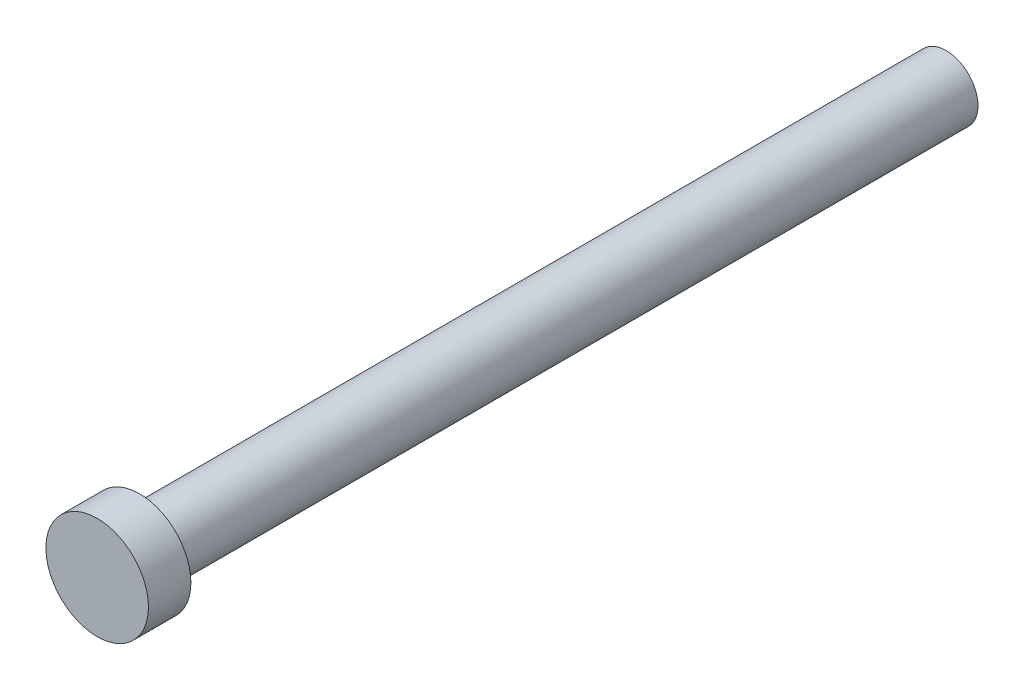
ISO-10303-21;
HEADER;
FILE_DESCRIPTION(('STEP AP214'),'2;1');
FILE_NAME('part.step','',(''),(''),'','','');
FILE_SCHEMA(('AUTOMOTIVE_DESIGN { 1 0 10303 214 1 1 1 1 }'));
ENDSEC;
DATA;
#1=APPLICATION_CONTEXT('core data for automotive mechanical design processes');
#2=APPLICATION_PROTOCOL_DEFINITION('international standard','automotive_design',2000,#1);
#3=PRODUCT_CONTEXT('',#1,'mechanical');
#4=PRODUCT('Part','Part','',(#3));
#5=PRODUCT_RELATED_PRODUCT_CATEGORY('part','',(#4));
#6=PRODUCT_DEFINITION_FORMATION('','',#4);
#7=PRODUCT_DEFINITION_CONTEXT('part definition',#1,'design');
#8=PRODUCT_DEFINITION('design','',#6,#7);
#9=PRODUCT_DEFINITION_SHAPE('','',#8);
#10=(LENGTH_UNIT() NAMED_UNIT(*) SI_UNIT(.MILLI.,.METRE.));
#11=(NAMED_UNIT(*) PLANE_ANGLE_UNIT() SI_UNIT($,.RADIAN.));
#12=(NAMED_UNIT(*) SI_UNIT($,.STERADIAN.) SOLID_ANGLE_UNIT());
#13=UNCERTAINTY_MEASURE_WITH_UNIT(LENGTH_MEASURE(1.E-05),#10,'distance_accuracy_value','');
#14=(GEOMETRIC_REPRESENTATION_CONTEXT(3) GLOBAL_UNCERTAINTY_ASSIGNED_CONTEXT((#13)) GLOBAL_UNIT_ASSIGNED_CONTEXT((#10,
#11,#12)) REPRESENTATION_CONTEXT('',''));
#15=CARTESIAN_POINT('',(0.,0.,0.));
#16=DIRECTION('',(0.,0.,1.));
#17=DIRECTION('',(1.,0.,0.));
#18=AXIS2_PLACEMENT_3D('',#15,#16,#17);
#19=CARTESIAN_POINT('',(0.,0.,40.));
#20=DIRECTION('',(0.,0.,-1.));
#21=DIRECTION('',(-1.,0.,0.));
#22=AXIS2_PLACEMENT_3D('',#19,#20,#21);
#23=CYLINDRICAL_SURFACE('',#22,1.5);
#24=CARTESIAN_POINT('',(0.,0.,0.));
#25=DIRECTION('',(0.,0.,1.));
#26=DIRECTION('',(1.,0.,0.));
#27=AXIS2_PLACEMENT_3D('',#24,#25,#26);
#28=CIRCLE('',#27,1.5);
#29=CARTESIAN_POINT('',(1.5,0.,0.));
#30=VERTEX_POINT('',#29);
#31=EDGE_CURVE('E38',#30,#30,#28,.T.);
#32=ORIENTED_EDGE('',*,*,#31,.T.);
#33=EDGE_LOOP('',(#32));
#34=FACE_BOUND('',#33,.T.);
#35=CARTESIAN_POINT('',(0.,0.,38.));
#36=DIRECTION('',(0.,0.,1.));
#37=DIRECTION('',(1.,0.,0.));
#38=AXIS2_PLACEMENT_3D('',#35,#36,#37);
#39=CIRCLE('',#38,1.5);
#40=CARTESIAN_POINT('',(1.5,0.,38.));
#41=VERTEX_POINT('',#40);
#42=EDGE_CURVE('E10',#41,#41,#39,.T.);
#43=ORIENTED_EDGE('',*,*,#42,.F.);
#44=EDGE_LOOP('',(#43));
#45=FACE_BOUND('',#44,.T.);
#46=ADVANCED_FACE('F32',(#34,#45),#23,.T.);
#47=CARTESIAN_POINT('',(0.,0.,0.));
#48=DIRECTION('',(0.,0.,1.));
#49=DIRECTION('',(1.,0.,0.));
#50=AXIS2_PLACEMENT_3D('',#47,#48,#49);
#51=PLANE('',#50);
#52=ORIENTED_EDGE('',*,*,#31,.F.);
#53=EDGE_LOOP('',(#52));
#54=FACE_BOUND('',#53,.T.);
#55=ADVANCED_FACE('F57',(#54),#51,.F.);
#56=CARTESIAN_POINT('',(0.,0.,38.));
#57=DIRECTION('',(0.,0.,1.));
#58=DIRECTION('',(1.,0.,0.));
#59=AXIS2_PLACEMENT_3D('',#56,#57,#58);
#60=CYLINDRICAL_SURFACE('',#59,2.41539436515518);
#61=CARTESIAN_POINT('',(0.,0.,38.));
#62=DIRECTION('',(0.,0.,1.));
#63=DIRECTION('',(1.,0.,0.));
#64=AXIS2_PLACEMENT_3D('',#61,#62,#63);
#65=CIRCLE('',#64,2.41539436515518);
#66=CARTESIAN_POINT('',(2.41539436515518,0.,38.));
#67=VERTEX_POINT('',#66);
#68=EDGE_CURVE('E42',#67,#67,#65,.T.);
#69=ORIENTED_EDGE('',*,*,#68,.T.);
#70=EDGE_LOOP('',(#69));
#71=FACE_BOUND('',#70,.T.);
#72=CARTESIAN_POINT('',(0.,0.,40.));
#73=DIRECTION('',(0.,0.,1.));
#74=DIRECTION('',(1.,0.,0.));
#75=AXIS2_PLACEMENT_3D('',#72,#73,#74);
#76=CIRCLE('',#75,2.41539436515518);
#77=CARTESIAN_POINT('',(2.41539436515518,0.,40.));
#78=VERTEX_POINT('',#77);
#79=EDGE_CURVE('E46',#78,#78,#76,.T.);
#80=ORIENTED_EDGE('',*,*,#79,.F.);
#81=EDGE_LOOP('',(#80));
#82=FACE_BOUND('',#81,.T.);
#83=ADVANCED_FACE('F54',(#71,#82),#60,.T.);
#84=CARTESIAN_POINT('',(0.,0.,38.));
#85=DIRECTION('',(0.,0.,1.));
#86=DIRECTION('',(1.,0.,0.));
#87=AXIS2_PLACEMENT_3D('',#84,#85,#86);
#88=PLANE('',#87);
#89=ORIENTED_EDGE('',*,*,#42,.T.);
#90=EDGE_LOOP('',(#89));
#91=FACE_BOUND('',#90,.T.);
#92=ORIENTED_EDGE('',*,*,#68,.F.);
#93=EDGE_LOOP('',(#92));
#94=FACE_BOUND('',#93,.T.);
#95=ADVANCED_FACE('F56',(#91,#94),#88,.F.);
#96=CARTESIAN_POINT('',(0.,0.,40.));
#97=DIRECTION('',(0.,0.,1.));
#98=DIRECTION('',(1.,0.,0.));
#99=AXIS2_PLACEMENT_3D('',#96,#97,#98);
#100=PLANE('',#99);
#101=ORIENTED_EDGE('',*,*,#79,.T.);
#102=EDGE_LOOP('',(#101));
#103=FACE_BOUND('',#102,.T.);
#104=ADVANCED_FACE('F52',(#103),#100,.T.);
#105=CLOSED_SHELL('',(#46,#55,#83,#95,#104));
#106=MANIFOLD_SOLID_BREP('B2',#105);
#107=ADVANCED_BREP_SHAPE_REPRESENTATION('',(#18,#106),#14);
#108=SHAPE_DEFINITION_REPRESENTATION(#9,#107);
ENDSEC;
END-ISO-10303-21;
